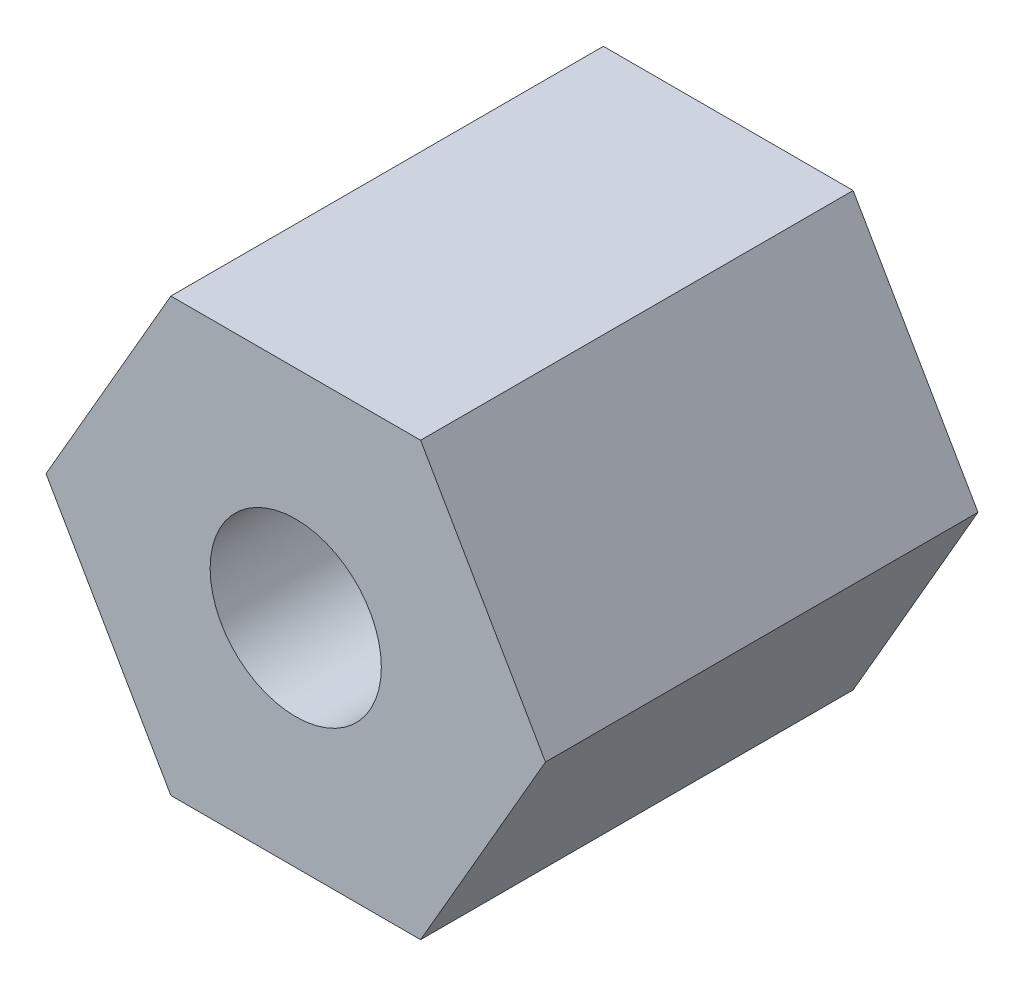
ISO-10303-21;
HEADER;
FILE_DESCRIPTION(('STEP AP214'),'2;1');
FILE_NAME('part.step','',(''),(''),'','','');
FILE_SCHEMA(('AUTOMOTIVE_DESIGN { 1 0 10303 214 1 1 1 1 }'));
ENDSEC;
DATA;
#1=APPLICATION_CONTEXT('core data for automotive mechanical design processes');
#2=APPLICATION_PROTOCOL_DEFINITION('international standard','automotive_design',2000,#1);
#3=PRODUCT_CONTEXT('',#1,'mechanical');
#4=PRODUCT('Part','Part','',(#3));
#5=PRODUCT_RELATED_PRODUCT_CATEGORY('part','',(#4));
#6=PRODUCT_DEFINITION_FORMATION('','',#4);
#7=PRODUCT_DEFINITION_CONTEXT('part definition',#1,'design');
#8=PRODUCT_DEFINITION('design','',#6,#7);
#9=PRODUCT_DEFINITION_SHAPE('','',#8);
#10=(LENGTH_UNIT() NAMED_UNIT(*) SI_UNIT(.MILLI.,.METRE.));
#11=(NAMED_UNIT(*) PLANE_ANGLE_UNIT() SI_UNIT($,.RADIAN.));
#12=(NAMED_UNIT(*) SI_UNIT($,.STERADIAN.) SOLID_ANGLE_UNIT());
#13=UNCERTAINTY_MEASURE_WITH_UNIT(LENGTH_MEASURE(1.E-05),#10,'distance_accuracy_value','');
#14=(GEOMETRIC_REPRESENTATION_CONTEXT(3) GLOBAL_UNCERTAINTY_ASSIGNED_CONTEXT((#13)) GLOBAL_UNIT_ASSIGNED_CONTEXT((#10,
#11,#12)) REPRESENTATION_CONTEXT('',''));
#15=CARTESIAN_POINT('',(0.,0.,0.));
#16=DIRECTION('',(0.,0.,1.));
#17=DIRECTION('',(1.,0.,0.));
#18=AXIS2_PLACEMENT_3D('',#15,#16,#17);
#19=CARTESIAN_POINT('',(2.7712812921102,-4.8,9.6));
#20=DIRECTION('',(-0.866025403784439,0.5,0.));
#21=DIRECTION('',(-0.5,-0.866025403784439,0.));
#22=AXIS2_PLACEMENT_3D('',#19,#20,#21);
#23=PLANE('',#22);
#24=DIRECTION('',(0.5,0.866025403784439,0.));
#25=VECTOR('',#24,1.);
#26=CARTESIAN_POINT('',(2.7712812921102,-4.8,0.));
#27=LINE('',#26,#25);
#28=CARTESIAN_POINT('',(2.7712812921102,-4.8,0.));
#29=VERTEX_POINT('',#28);
#30=CARTESIAN_POINT('',(5.54256258422041,0.,0.));
#31=VERTEX_POINT('',#30);
#32=EDGE_CURVE('E120',#29,#31,#27,.T.);
#33=ORIENTED_EDGE('',*,*,#32,.T.);
#34=DIRECTION('',(0.,0.,-1.));
#35=VECTOR('',#34,1.);
#36=CARTESIAN_POINT('',(5.54256258422041,0.,9.6));
#37=LINE('',#36,#35);
#38=CARTESIAN_POINT('',(5.54256258422041,0.,9.6));
#39=VERTEX_POINT('',#38);
#40=EDGE_CURVE('E11',#39,#31,#37,.T.);
#41=ORIENTED_EDGE('',*,*,#40,.F.);
#42=DIRECTION('',(0.5,0.866025403784439,0.));
#43=VECTOR('',#42,1.);
#44=CARTESIAN_POINT('',(2.7712812921102,-4.8,9.6));
#45=LINE('',#44,#43);
#46=CARTESIAN_POINT('',(2.7712812921102,-4.8,9.6));
#47=VERTEX_POINT('',#46);
#48=EDGE_CURVE('E131',#47,#39,#45,.T.);
#49=ORIENTED_EDGE('',*,*,#48,.F.);
#50=DIRECTION('',(0.,0.,-1.));
#51=VECTOR('',#50,1.);
#52=CARTESIAN_POINT('',(2.7712812921102,-4.8,9.6));
#53=LINE('',#52,#51);
#54=EDGE_CURVE('E116',#47,#29,#53,.T.);
#55=ORIENTED_EDGE('',*,*,#54,.T.);
#56=EDGE_LOOP('',(#33,#41,#49,#55));
#57=FACE_BOUND('',#56,.T.);
#58=ADVANCED_FACE('F36',(#57),#23,.F.);
#59=CARTESIAN_POINT('',(5.54256258422041,0.,9.6));
#60=DIRECTION('',(-0.866025403784439,-0.5,0.));
#61=DIRECTION('',(0.5,-0.866025403784439,0.));
#62=AXIS2_PLACEMENT_3D('',#59,#60,#61);
#63=PLANE('',#62);
#64=DIRECTION('',(-0.5,0.866025403784439,0.));
#65=VECTOR('',#64,1.);
#66=CARTESIAN_POINT('',(5.54256258422041,0.,0.));
#67=LINE('',#66,#65);
#68=CARTESIAN_POINT('',(2.7712812921102,4.8,0.));
#69=VERTEX_POINT('',#68);
#70=EDGE_CURVE('E123',#31,#69,#67,.T.);
#71=ORIENTED_EDGE('',*,*,#70,.T.);
#72=DIRECTION('',(0.,0.,-1.));
#73=VECTOR('',#72,1.);
#74=CARTESIAN_POINT('',(2.7712812921102,4.8,9.6));
#75=LINE('',#74,#73);
#76=CARTESIAN_POINT('',(2.7712812921102,4.8,9.6));
#77=VERTEX_POINT('',#76);
#78=EDGE_CURVE('E44',#77,#69,#75,.T.);
#79=ORIENTED_EDGE('',*,*,#78,.F.);
#80=DIRECTION('',(-0.5,0.866025403784439,0.));
#81=VECTOR('',#80,1.);
#82=CARTESIAN_POINT('',(5.54256258422041,0.,9.6));
#83=LINE('',#82,#81);
#84=EDGE_CURVE('E89',#39,#77,#83,.T.);
#85=ORIENTED_EDGE('',*,*,#84,.F.);
#86=ORIENTED_EDGE('',*,*,#40,.T.);
#87=EDGE_LOOP('',(#71,#79,#85,#86));
#88=FACE_BOUND('',#87,.T.);
#89=ADVANCED_FACE('F156',(#88),#63,.F.);
#90=CARTESIAN_POINT('',(2.7712812921102,4.8,9.6));
#91=DIRECTION('',(0.,-1.,0.));
#92=DIRECTION('',(1.,0.,0.));
#93=AXIS2_PLACEMENT_3D('',#90,#91,#92);
#94=PLANE('',#93);
#95=DIRECTION('',(-1.,0.,0.));
#96=VECTOR('',#95,1.);
#97=CARTESIAN_POINT('',(2.7712812921102,4.8,0.));
#98=LINE('',#97,#96);
#99=CARTESIAN_POINT('',(-2.7712812921102,4.8,0.));
#100=VERTEX_POINT('',#99);
#101=EDGE_CURVE('E126',#69,#100,#98,.T.);
#102=ORIENTED_EDGE('',*,*,#101,.T.);
#103=DIRECTION('',(0.,0.,-1.));
#104=VECTOR('',#103,1.);
#105=CARTESIAN_POINT('',(-2.7712812921102,4.8,9.6));
#106=LINE('',#105,#104);
#107=CARTESIAN_POINT('',(-2.7712812921102,4.8,9.6));
#108=VERTEX_POINT('',#107);
#109=EDGE_CURVE('E111',#108,#100,#106,.T.);
#110=ORIENTED_EDGE('',*,*,#109,.F.);
#111=DIRECTION('',(-1.,0.,0.));
#112=VECTOR('',#111,1.);
#113=CARTESIAN_POINT('',(2.7712812921102,4.8,9.6));
#114=LINE('',#113,#112);
#115=EDGE_CURVE('E102',#77,#108,#114,.T.);
#116=ORIENTED_EDGE('',*,*,#115,.F.);
#117=ORIENTED_EDGE('',*,*,#78,.T.);
#118=EDGE_LOOP('',(#102,#110,#116,#117));
#119=FACE_BOUND('',#118,.T.);
#120=ADVANCED_FACE('F137',(#119),#94,.F.);
#121=CARTESIAN_POINT('',(-2.7712812921102,4.8,9.6));
#122=DIRECTION('',(0.866025403784439,-0.5,0.));
#123=DIRECTION('',(0.5,0.866025403784439,0.));
#124=AXIS2_PLACEMENT_3D('',#121,#122,#123);
#125=PLANE('',#124);
#126=DIRECTION('',(-0.5,-0.866025403784438,0.));
#127=VECTOR('',#126,1.);
#128=CARTESIAN_POINT('',(-2.7712812921102,4.8,0.));
#129=LINE('',#128,#127);
#130=CARTESIAN_POINT('',(-5.54256258422041,0.,0.));
#131=VERTEX_POINT('',#130);
#132=EDGE_CURVE('E110',#100,#131,#129,.T.);
#133=ORIENTED_EDGE('',*,*,#132,.T.);
#134=DIRECTION('',(0.,0.,-1.));
#135=VECTOR('',#134,1.);
#136=CARTESIAN_POINT('',(-5.54256258422041,0.,9.6));
#137=LINE('',#136,#135);
#138=CARTESIAN_POINT('',(-5.54256258422041,0.,9.6));
#139=VERTEX_POINT('',#138);
#140=EDGE_CURVE('E107',#139,#131,#137,.T.);
#141=ORIENTED_EDGE('',*,*,#140,.F.);
#142=DIRECTION('',(-0.5,-0.866025403784438,0.));
#143=VECTOR('',#142,1.);
#144=CARTESIAN_POINT('',(-2.7712812921102,4.8,9.6));
#145=LINE('',#144,#143);
#146=EDGE_CURVE('E96',#108,#139,#145,.T.);
#147=ORIENTED_EDGE('',*,*,#146,.F.);
#148=ORIENTED_EDGE('',*,*,#109,.T.);
#149=EDGE_LOOP('',(#133,#141,#147,#148));
#150=FACE_BOUND('',#149,.T.);
#151=ADVANCED_FACE('F108',(#150),#125,.F.);
#152=CARTESIAN_POINT('',(-5.54256258422041,0.,9.6));
#153=DIRECTION('',(0.866025403784439,0.5,0.));
#154=DIRECTION('',(-0.5,0.866025403784439,0.));
#155=AXIS2_PLACEMENT_3D('',#152,#153,#154);
#156=PLANE('',#155);
#157=DIRECTION('',(0.5,-0.866025403784439,0.));
#158=VECTOR('',#157,1.);
#159=CARTESIAN_POINT('',(-5.54256258422041,0.,0.));
#160=LINE('',#159,#158);
#161=CARTESIAN_POINT('',(-2.77128129211021,-4.8,0.));
#162=VERTEX_POINT('',#161);
#163=EDGE_CURVE('E75',#131,#162,#160,.T.);
#164=ORIENTED_EDGE('',*,*,#163,.T.);
#165=DIRECTION('',(0.,0.,-1.));
#166=VECTOR('',#165,1.);
#167=CARTESIAN_POINT('',(-2.77128129211021,-4.8,9.6));
#168=LINE('',#167,#166);
#169=CARTESIAN_POINT('',(-2.77128129211021,-4.8,9.6));
#170=VERTEX_POINT('',#169);
#171=EDGE_CURVE('E112',#170,#162,#168,.T.);
#172=ORIENTED_EDGE('',*,*,#171,.F.);
#173=DIRECTION('',(0.5,-0.866025403784439,0.));
#174=VECTOR('',#173,1.);
#175=CARTESIAN_POINT('',(-5.54256258422041,0.,9.6));
#176=LINE('',#175,#174);
#177=EDGE_CURVE('E100',#139,#170,#176,.T.);
#178=ORIENTED_EDGE('',*,*,#177,.F.);
#179=ORIENTED_EDGE('',*,*,#140,.T.);
#180=EDGE_LOOP('',(#164,#172,#178,#179));
#181=FACE_BOUND('',#180,.T.);
#182=ADVANCED_FACE('F114',(#181),#156,.F.);
#183=CARTESIAN_POINT('',(-2.77128129211021,-4.8,9.6));
#184=DIRECTION('',(0.,1.,0.));
#185=DIRECTION('',(-1.,0.,0.));
#186=AXIS2_PLACEMENT_3D('',#183,#184,#185);
#187=PLANE('',#186);
#188=DIRECTION('',(1.,0.,0.));
#189=VECTOR('',#188,1.);
#190=CARTESIAN_POINT('',(-2.77128129211021,-4.8,0.));
#191=LINE('',#190,#189);
#192=EDGE_CURVE('E81',#162,#29,#191,.T.);
#193=ORIENTED_EDGE('',*,*,#192,.T.);
#194=ORIENTED_EDGE('',*,*,#54,.F.);
#195=DIRECTION('',(1.,0.,0.));
#196=VECTOR('',#195,1.);
#197=CARTESIAN_POINT('',(-2.77128129211021,-4.8,9.6));
#198=LINE('',#197,#196);
#199=EDGE_CURVE('E52',#170,#47,#198,.T.);
#200=ORIENTED_EDGE('',*,*,#199,.F.);
#201=ORIENTED_EDGE('',*,*,#171,.T.);
#202=EDGE_LOOP('',(#193,#194,#200,#201));
#203=FACE_BOUND('',#202,.T.);
#204=ADVANCED_FACE('F144',(#203),#187,.F.);
#205=CARTESIAN_POINT('',(0.,0.,9.6));
#206=DIRECTION('',(0.,0.,1.));
#207=DIRECTION('',(1.,0.,0.));
#208=AXIS2_PLACEMENT_3D('',#205,#206,#207);
#209=PLANE('',#208);
#210=CARTESIAN_POINT('',(0.,0.,9.6));
#211=DIRECTION('',(0.,0.,-1.));
#212=DIRECTION('',(-1.,0.,0.));
#213=AXIS2_PLACEMENT_3D('',#210,#211,#212);
#214=CIRCLE('',#213,1.9);
#215=CARTESIAN_POINT('',(-1.9,0.,9.6));
#216=VERTEX_POINT('',#215);
#217=EDGE_CURVE('E124',#216,#216,#214,.T.);
#218=ORIENTED_EDGE('',*,*,#217,.T.);
#219=EDGE_LOOP('',(#218));
#220=FACE_BOUND('',#219,.T.);
#221=ORIENTED_EDGE('',*,*,#48,.T.);
#222=ORIENTED_EDGE('',*,*,#84,.T.);
#223=ORIENTED_EDGE('',*,*,#115,.T.);
#224=ORIENTED_EDGE('',*,*,#146,.T.);
#225=ORIENTED_EDGE('',*,*,#177,.T.);
#226=ORIENTED_EDGE('',*,*,#199,.T.);
#227=EDGE_LOOP('',(#221,#222,#223,#224,#225,#226));
#228=FACE_BOUND('',#227,.T.);
#229=ADVANCED_FACE('F98',(#220,#228),#209,.T.);
#230=CARTESIAN_POINT('',(0.,0.,0.));
#231=DIRECTION('',(0.,0.,1.));
#232=DIRECTION('',(1.,0.,0.));
#233=AXIS2_PLACEMENT_3D('',#230,#231,#232);
#234=PLANE('',#233);
#235=CARTESIAN_POINT('',(0.,0.,0.));
#236=DIRECTION('',(0.,0.,-1.));
#237=DIRECTION('',(-1.,0.,0.));
#238=AXIS2_PLACEMENT_3D('',#235,#236,#237);
#239=CIRCLE('',#238,1.9);
#240=CARTESIAN_POINT('',(-1.9,0.,0.));
#241=VERTEX_POINT('',#240);
#242=EDGE_CURVE('E211',#241,#241,#239,.T.);
#243=ORIENTED_EDGE('',*,*,#242,.F.);
#244=EDGE_LOOP('',(#243));
#245=FACE_BOUND('',#244,.T.);
#246=ORIENTED_EDGE('',*,*,#32,.F.);
#247=ORIENTED_EDGE('',*,*,#192,.F.);
#248=ORIENTED_EDGE('',*,*,#163,.F.);
#249=ORIENTED_EDGE('',*,*,#132,.F.);
#250=ORIENTED_EDGE('',*,*,#101,.F.);
#251=ORIENTED_EDGE('',*,*,#70,.F.);
#252=EDGE_LOOP('',(#246,#247,#248,#249,#250,#251));
#253=FACE_BOUND('',#252,.T.);
#254=ADVANCED_FACE('F140',(#245,#253),#234,.F.);
#255=CARTESIAN_POINT('',(0.,0.,9.6));
#256=DIRECTION('',(0.,0.,-1.));
#257=DIRECTION('',(-1.,0.,0.));
#258=AXIS2_PLACEMENT_3D('',#255,#256,#257);
#259=CYLINDRICAL_SURFACE('',#258,1.9);
#260=ORIENTED_EDGE('',*,*,#217,.F.);
#261=EDGE_LOOP('',(#260));
#262=FACE_BOUND('',#261,.T.);
#263=ORIENTED_EDGE('',*,*,#242,.T.);
#264=EDGE_LOOP('',(#263));
#265=FACE_BOUND('',#264,.T.);
#266=ADVANCED_FACE('F193',(#262,#265),#259,.F.);
#267=CLOSED_SHELL('',(#58,#89,#120,#151,#182,#204,#229,#254,#266));
#268=MANIFOLD_SOLID_BREP('B2',#267);
#269=ADVANCED_BREP_SHAPE_REPRESENTATION('',(#18,#268),#14);
#270=SHAPE_DEFINITION_REPRESENTATION(#9,#269);
ENDSEC;
END-ISO-10303-21;
